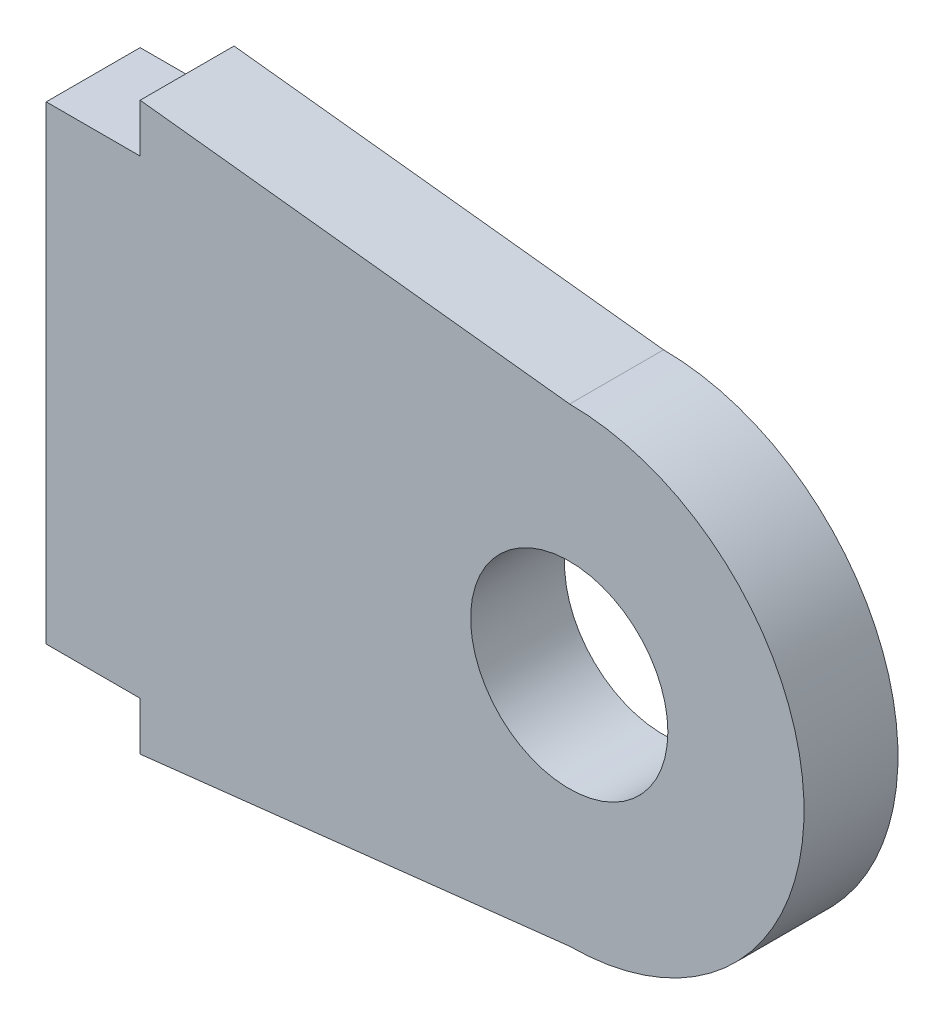
ISO-10303-21;
HEADER;
FILE_DESCRIPTION(('STEP AP214'),'2;1');
FILE_NAME('part.step','',(''),(''),'','','');
FILE_SCHEMA(('AUTOMOTIVE_DESIGN { 1 0 10303 214 1 1 1 1 }'));
ENDSEC;
DATA;
#1=APPLICATION_CONTEXT('core data for automotive mechanical design processes');
#2=APPLICATION_PROTOCOL_DEFINITION('international standard','automotive_design',2000,#1);
#3=PRODUCT_CONTEXT('',#1,'mechanical');
#4=PRODUCT('Part','Part','',(#3));
#5=PRODUCT_RELATED_PRODUCT_CATEGORY('part','',(#4));
#6=PRODUCT_DEFINITION_FORMATION('','',#4);
#7=PRODUCT_DEFINITION_CONTEXT('part definition',#1,'design');
#8=PRODUCT_DEFINITION('design','',#6,#7);
#9=PRODUCT_DEFINITION_SHAPE('','',#8);
#10=(LENGTH_UNIT() NAMED_UNIT(*) SI_UNIT(.MILLI.,.METRE.));
#11=(NAMED_UNIT(*) PLANE_ANGLE_UNIT() SI_UNIT($,.RADIAN.));
#12=(NAMED_UNIT(*) SI_UNIT($,.STERADIAN.) SOLID_ANGLE_UNIT());
#13=UNCERTAINTY_MEASURE_WITH_UNIT(LENGTH_MEASURE(1.E-05),#10,'distance_accuracy_value','');
#14=(GEOMETRIC_REPRESENTATION_CONTEXT(3) GLOBAL_UNCERTAINTY_ASSIGNED_CONTEXT((#13)) GLOBAL_UNIT_ASSIGNED_CONTEXT((#10,
#11,#12)) REPRESENTATION_CONTEXT('',''));
#15=CARTESIAN_POINT('',(0.,0.,0.));
#16=DIRECTION('',(0.,0.,1.));
#17=DIRECTION('',(1.,0.,0.));
#18=AXIS2_PLACEMENT_3D('',#15,#16,#17);
#19=CARTESIAN_POINT('',(0.878927207423718,-7.8073920540141,4.));
#20=DIRECTION('',(-0.111869633286238,0.993722891528822,0.));
#21=DIRECTION('',(-0.993722891528822,-0.111869633286239,0.));
#22=AXIS2_PLACEMENT_3D('',#19,#20,#21);
#23=PLANE('',#22);
#24=DIRECTION('',(0.993722891528822,0.111869633286238,0.));
#25=VECTOR('',#24,1.);
#26=CARTESIAN_POINT('',(0.878927207423718,-7.8073920540141,0.));
#27=LINE('',#26,#25);
#28=CARTESIAN_POINT('',(2.,-7.68118584173721,0.));
#29=VERTEX_POINT('',#28);
#30=CARTESIAN_POINT('',(20.2922651244406,-5.62191055595049,0.));
#31=VERTEX_POINT('',#30);
#32=EDGE_CURVE('E141',#29,#31,#27,.T.);
#33=ORIENTED_EDGE('',*,*,#32,.T.);
#34=DIRECTION('',(0.,0.,-1.));
#35=VECTOR('',#34,1.);
#36=CARTESIAN_POINT('',(20.2922651244406,-5.62191055595049,4.));
#37=LINE('',#36,#35);
#38=CARTESIAN_POINT('',(20.2922651244406,-5.62191055595049,4.));
#39=VERTEX_POINT('',#38);
#40=EDGE_CURVE('E11',#39,#31,#37,.T.);
#41=ORIENTED_EDGE('',*,*,#40,.F.);
#42=DIRECTION('',(0.993722891528822,0.111869633286238,0.));
#43=VECTOR('',#42,1.);
#44=CARTESIAN_POINT('',(0.878927207423718,-7.8073920540141,4.));
#45=LINE('',#44,#43);
#46=CARTESIAN_POINT('',(2.,-7.68118584173721,4.));
#47=VERTEX_POINT('',#46);
#48=EDGE_CURVE('E163',#47,#39,#45,.T.);
#49=ORIENTED_EDGE('',*,*,#48,.F.);
#50=DIRECTION('',(0.,0.,-1.));
#51=VECTOR('',#50,1.);
#52=CARTESIAN_POINT('',(2.,-7.68118584173721,4.));
#53=LINE('',#52,#51);
#54=EDGE_CURVE('E55',#47,#29,#53,.T.);
#55=ORIENTED_EDGE('',*,*,#54,.T.);
#56=EDGE_LOOP('',(#33,#41,#49,#55));
#57=FACE_BOUND('',#56,.T.);
#58=ADVANCED_FACE('F39',(#57),#23,.F.);
#59=CARTESIAN_POINT('',(20.2761325622203,4.37808944404951,4.));
#60=DIRECTION('',(0.,0.,-1.));
#61=DIRECTION('',(-1.,0.,0.));
#62=AXIS2_PLACEMENT_3D('',#59,#60,#61);
#63=CYLINDRICAL_SURFACE('',#62,10.0000130129697);
#64=CARTESIAN_POINT('',(20.2761325622203,4.37808944404951,0.));
#65=DIRECTION('',(0.,0.,1.));
#66=DIRECTION('',(1.,0.,0.));
#67=AXIS2_PLACEMENT_3D('',#64,#65,#66);
#68=CIRCLE('',#67,10.0000130129697);
#69=CARTESIAN_POINT('',(20.2922651244406,14.3780894440495,0.));
#70=VERTEX_POINT('',#69);
#71=EDGE_CURVE('E143',#31,#70,#68,.T.);
#72=ORIENTED_EDGE('',*,*,#71,.T.);
#73=DIRECTION('',(0.,0.,-1.));
#74=VECTOR('',#73,1.);
#75=CARTESIAN_POINT('',(20.2922651244406,14.3780894440495,4.));
#76=LINE('',#75,#74);
#77=CARTESIAN_POINT('',(20.2922651244406,14.3780894440495,4.));
#78=VERTEX_POINT('',#77);
#79=EDGE_CURVE('E47',#78,#70,#76,.T.);
#80=ORIENTED_EDGE('',*,*,#79,.F.);
#81=CARTESIAN_POINT('',(20.2761325622203,4.37808944404951,4.));
#82=DIRECTION('',(0.,0.,1.));
#83=DIRECTION('',(1.,0.,0.));
#84=AXIS2_PLACEMENT_3D('',#81,#82,#83);
#85=CIRCLE('',#84,10.0000130129697);
#86=EDGE_CURVE('E94',#39,#78,#85,.T.);
#87=ORIENTED_EDGE('',*,*,#86,.F.);
#88=ORIENTED_EDGE('',*,*,#40,.T.);
#89=EDGE_LOOP('',(#72,#80,#87,#88));
#90=FACE_BOUND('',#89,.T.);
#91=ADVANCED_FACE('F176',(#90),#63,.T.);
#92=CARTESIAN_POINT('',(1.85232898374949,16.4539889845211,4.));
#93=DIRECTION('',(0.111869633286238,0.993722891528822,0.));
#94=DIRECTION('',(-0.993722891528822,0.111869633286239,0.));
#95=AXIS2_PLACEMENT_3D('',#92,#93,#94);
#96=PLANE('',#95);
#97=DIRECTION('',(0.993722891528822,-0.111869633286238,0.));
#98=VECTOR('',#97,1.);
#99=CARTESIAN_POINT('',(1.85232898374949,16.4539889845211,0.));
#100=LINE('',#99,#98);
#101=CARTESIAN_POINT('',(2.,16.4373647298362,0.));
#102=VERTEX_POINT('',#101);
#103=EDGE_CURVE('E146',#102,#70,#100,.T.);
#104=ORIENTED_EDGE('',*,*,#103,.F.);
#105=DIRECTION('',(0.,0.,-1.));
#106=VECTOR('',#105,1.);
#107=CARTESIAN_POINT('',(2.,16.4373647298362,4.));
#108=LINE('',#107,#106);
#109=CARTESIAN_POINT('',(2.,16.4373647298362,4.));
#110=VERTEX_POINT('',#109);
#111=EDGE_CURVE('E169',#110,#102,#108,.T.);
#112=ORIENTED_EDGE('',*,*,#111,.F.);
#113=DIRECTION('',(0.993722891528822,-0.111869633286238,0.));
#114=VECTOR('',#113,1.);
#115=CARTESIAN_POINT('',(1.85232898374949,16.4539889845211,4.));
#116=LINE('',#115,#114);
#117=EDGE_CURVE('E175',#110,#78,#116,.T.);
#118=ORIENTED_EDGE('',*,*,#117,.T.);
#119=ORIENTED_EDGE('',*,*,#79,.T.);
#120=EDGE_LOOP('',(#104,#112,#118,#119));
#121=FACE_BOUND('',#120,.T.);
#122=ADVANCED_FACE('F173',(#121),#96,.T.);
#123=CARTESIAN_POINT('',(2.,0.,4.));
#124=DIRECTION('',(-1.,0.,0.));
#125=DIRECTION('',(0.,0.,1.));
#126=AXIS2_PLACEMENT_3D('',#123,#124,#125);
#127=PLANE('',#126);
#128=DIRECTION('',(0.,1.,0.));
#129=VECTOR('',#128,1.);
#130=CARTESIAN_POINT('',(2.,0.,0.));
#131=LINE('',#130,#129);
#132=CARTESIAN_POINT('',(2.,14.3780894440495,0.));
#133=VERTEX_POINT('',#132);
#134=EDGE_CURVE('E149',#133,#102,#131,.T.);
#135=ORIENTED_EDGE('',*,*,#134,.F.);
#136=DIRECTION('',(0.,0.,-1.));
#137=VECTOR('',#136,1.);
#138=CARTESIAN_POINT('',(2.,14.3780894440495,4.));
#139=LINE('',#138,#137);
#140=CARTESIAN_POINT('',(2.,14.3780894440495,4.));
#141=VERTEX_POINT('',#140);
#142=EDGE_CURVE('E167',#141,#133,#139,.T.);
#143=ORIENTED_EDGE('',*,*,#142,.F.);
#144=DIRECTION('',(0.,1.,0.));
#145=VECTOR('',#144,1.);
#146=CARTESIAN_POINT('',(2.,0.,4.));
#147=LINE('',#146,#145);
#148=EDGE_CURVE('E186',#141,#110,#147,.T.);
#149=ORIENTED_EDGE('',*,*,#148,.T.);
#150=ORIENTED_EDGE('',*,*,#111,.T.);
#151=EDGE_LOOP('',(#135,#143,#149,#150));
#152=FACE_BOUND('',#151,.T.);
#153=ADVANCED_FACE('F184',(#152),#127,.T.);
#154=CARTESIAN_POINT('',(0.,14.3780894440495,4.));
#155=DIRECTION('',(0.,-1.,0.));
#156=DIRECTION('',(0.,0.,-1.));
#157=AXIS2_PLACEMENT_3D('',#154,#155,#156);
#158=PLANE('',#157);
#159=DIRECTION('',(-1.,0.,0.));
#160=VECTOR('',#159,1.);
#161=CARTESIAN_POINT('',(0.,14.3780894440495,0.));
#162=LINE('',#161,#160);
#163=CARTESIAN_POINT('',(-2.,14.3780894440495,0.));
#164=VERTEX_POINT('',#163);
#165=EDGE_CURVE('E152',#133,#164,#162,.T.);
#166=ORIENTED_EDGE('',*,*,#165,.T.);
#167=DIRECTION('',(0.,0.,-1.));
#168=VECTOR('',#167,1.);
#169=CARTESIAN_POINT('',(-2.,14.3780894440495,4.));
#170=LINE('',#169,#168);
#171=CARTESIAN_POINT('',(-2.,14.3780894440495,4.));
#172=VERTEX_POINT('',#171);
#173=EDGE_CURVE('E130',#172,#164,#170,.T.);
#174=ORIENTED_EDGE('',*,*,#173,.F.);
#175=DIRECTION('',(-1.,0.,0.));
#176=VECTOR('',#175,1.);
#177=CARTESIAN_POINT('',(0.,14.3780894440495,4.));
#178=LINE('',#177,#176);
#179=EDGE_CURVE('E118',#141,#172,#178,.T.);
#180=ORIENTED_EDGE('',*,*,#179,.F.);
#181=ORIENTED_EDGE('',*,*,#142,.T.);
#182=EDGE_LOOP('',(#166,#174,#180,#181));
#183=FACE_BOUND('',#182,.T.);
#184=ADVANCED_FACE('F213',(#183),#158,.F.);
#185=CARTESIAN_POINT('',(-2.,0.,4.));
#186=DIRECTION('',(1.,0.,0.));
#187=DIRECTION('',(0.,0.,-1.));
#188=AXIS2_PLACEMENT_3D('',#185,#186,#187);
#189=PLANE('',#188);
#190=DIRECTION('',(0.,-1.,0.));
#191=VECTOR('',#190,1.);
#192=CARTESIAN_POINT('',(-2.,0.,0.));
#193=LINE('',#192,#191);
#194=CARTESIAN_POINT('',(-2.,-5.62191055595049,0.));
#195=VERTEX_POINT('',#194);
#196=EDGE_CURVE('E127',#164,#195,#193,.T.);
#197=ORIENTED_EDGE('',*,*,#196,.T.);
#198=DIRECTION('',(0.,0.,-1.));
#199=VECTOR('',#198,1.);
#200=CARTESIAN_POINT('',(-2.,-5.62191055595049,4.));
#201=LINE('',#200,#199);
#202=CARTESIAN_POINT('',(-2.,-5.62191055595049,4.));
#203=VERTEX_POINT('',#202);
#204=EDGE_CURVE('E124',#203,#195,#201,.T.);
#205=ORIENTED_EDGE('',*,*,#204,.F.);
#206=DIRECTION('',(0.,-1.,0.));
#207=VECTOR('',#206,1.);
#208=CARTESIAN_POINT('',(-2.,0.,4.));
#209=LINE('',#208,#207);
#210=EDGE_CURVE('E109',#172,#203,#209,.T.);
#211=ORIENTED_EDGE('',*,*,#210,.F.);
#212=ORIENTED_EDGE('',*,*,#173,.T.);
#213=EDGE_LOOP('',(#197,#205,#211,#212));
#214=FACE_BOUND('',#213,.T.);
#215=ADVANCED_FACE('F125',(#214),#189,.F.);
#216=CARTESIAN_POINT('',(0.,-5.62191055595049,4.));
#217=DIRECTION('',(0.,1.,0.));
#218=DIRECTION('',(0.,0.,1.));
#219=AXIS2_PLACEMENT_3D('',#216,#217,#218);
#220=PLANE('',#219);
#221=DIRECTION('',(1.,0.,0.));
#222=VECTOR('',#221,1.);
#223=CARTESIAN_POINT('',(0.,-5.62191055595049,0.));
#224=LINE('',#223,#222);
#225=CARTESIAN_POINT('',(2.,-5.62191055595049,0.));
#226=VERTEX_POINT('',#225);
#227=EDGE_CURVE('E155',#195,#226,#224,.T.);
#228=ORIENTED_EDGE('',*,*,#227,.T.);
#229=DIRECTION('',(0.,0.,-1.));
#230=VECTOR('',#229,1.);
#231=CARTESIAN_POINT('',(2.,-5.62191055595049,4.));
#232=LINE('',#231,#230);
#233=CARTESIAN_POINT('',(2.,-5.62191055595049,4.));
#234=VERTEX_POINT('',#233);
#235=EDGE_CURVE('E82',#234,#226,#232,.T.);
#236=ORIENTED_EDGE('',*,*,#235,.F.);
#237=DIRECTION('',(1.,0.,0.));
#238=VECTOR('',#237,1.);
#239=CARTESIAN_POINT('',(0.,-5.62191055595049,4.));
#240=LINE('',#239,#238);
#241=EDGE_CURVE('E115',#203,#234,#240,.T.);
#242=ORIENTED_EDGE('',*,*,#241,.F.);
#243=ORIENTED_EDGE('',*,*,#204,.T.);
#244=EDGE_LOOP('',(#228,#236,#242,#243));
#245=FACE_BOUND('',#244,.T.);
#246=ADVANCED_FACE('F132',(#245),#220,.F.);
#247=CARTESIAN_POINT('',(2.,0.,4.));
#248=DIRECTION('',(-1.,0.,0.));
#249=DIRECTION('',(0.,0.,1.));
#250=AXIS2_PLACEMENT_3D('',#247,#248,#249);
#251=PLANE('',#250);
#252=DIRECTION('',(0.,1.,0.));
#253=VECTOR('',#252,1.);
#254=CARTESIAN_POINT('',(2.,0.,0.));
#255=LINE('',#254,#253);
#256=EDGE_CURVE('E157',#29,#226,#255,.T.);
#257=ORIENTED_EDGE('',*,*,#256,.F.);
#258=ORIENTED_EDGE('',*,*,#54,.F.);
#259=DIRECTION('',(0.,1.,0.));
#260=VECTOR('',#259,1.);
#261=CARTESIAN_POINT('',(2.,0.,4.));
#262=LINE('',#261,#260);
#263=EDGE_CURVE('E133',#47,#234,#262,.T.);
#264=ORIENTED_EDGE('',*,*,#263,.T.);
#265=ORIENTED_EDGE('',*,*,#235,.T.);
#266=EDGE_LOOP('',(#257,#258,#264,#265));
#267=FACE_BOUND('',#266,.T.);
#268=ADVANCED_FACE('F191',(#267),#251,.T.);
#269=CARTESIAN_POINT('',(20.2761325622203,4.37808944404951,4.));
#270=DIRECTION('',(0.,0.,-1.));
#271=DIRECTION('',(-1.,0.,0.));
#272=AXIS2_PLACEMENT_3D('',#269,#270,#271);
#273=CYLINDRICAL_SURFACE('',#272,4.2);
#274=CARTESIAN_POINT('',(20.2761325622203,4.37808944404951,4.));
#275=DIRECTION('',(0.,0.,1.));
#276=DIRECTION('',(1.,0.,0.));
#277=AXIS2_PLACEMENT_3D('',#274,#275,#276);
#278=CIRCLE('',#277,4.2);
#279=CARTESIAN_POINT('',(24.4761325622203,4.37808944404951,4.));
#280=VERTEX_POINT('',#279);
#281=EDGE_CURVE('E135',#280,#280,#278,.T.);
#282=ORIENTED_EDGE('',*,*,#281,.T.);
#283=EDGE_LOOP('',(#282));
#284=FACE_BOUND('',#283,.T.);
#285=CARTESIAN_POINT('',(20.2761325622203,4.37808944404951,0.));
#286=DIRECTION('',(0.,0.,1.));
#287=DIRECTION('',(1.,0.,0.));
#288=AXIS2_PLACEMENT_3D('',#285,#286,#287);
#289=CIRCLE('',#288,4.2);
#290=CARTESIAN_POINT('',(24.4761325622203,4.37808944404951,0.));
#291=VERTEX_POINT('',#290);
#292=EDGE_CURVE('E160',#291,#291,#289,.T.);
#293=ORIENTED_EDGE('',*,*,#292,.F.);
#294=EDGE_LOOP('',(#293));
#295=FACE_BOUND('',#294,.T.);
#296=ADVANCED_FACE('F193',(#284,#295),#273,.F.);
#297=CARTESIAN_POINT('',(0.,0.,4.));
#298=DIRECTION('',(0.,0.,1.));
#299=DIRECTION('',(1.,0.,0.));
#300=AXIS2_PLACEMENT_3D('',#297,#298,#299);
#301=PLANE('',#300);
#302=ORIENTED_EDGE('',*,*,#48,.T.);
#303=ORIENTED_EDGE('',*,*,#86,.T.);
#304=ORIENTED_EDGE('',*,*,#117,.F.);
#305=ORIENTED_EDGE('',*,*,#148,.F.);
#306=ORIENTED_EDGE('',*,*,#179,.T.);
#307=ORIENTED_EDGE('',*,*,#210,.T.);
#308=ORIENTED_EDGE('',*,*,#241,.T.);
#309=ORIENTED_EDGE('',*,*,#263,.F.);
#310=EDGE_LOOP('',(#302,#303,#304,#305,#306,#307,#308,#309));
#311=FACE_BOUND('',#310,.T.);
#312=ORIENTED_EDGE('',*,*,#281,.F.);
#313=EDGE_LOOP('',(#312));
#314=FACE_BOUND('',#313,.T.);
#315=ADVANCED_FACE('F111',(#311,#314),#301,.T.);
#316=CARTESIAN_POINT('',(0.,0.,0.));
#317=DIRECTION('',(0.,0.,1.));
#318=DIRECTION('',(1.,0.,0.));
#319=AXIS2_PLACEMENT_3D('',#316,#317,#318);
#320=PLANE('',#319);
#321=ORIENTED_EDGE('',*,*,#32,.F.);
#322=ORIENTED_EDGE('',*,*,#256,.T.);
#323=ORIENTED_EDGE('',*,*,#227,.F.);
#324=ORIENTED_EDGE('',*,*,#196,.F.);
#325=ORIENTED_EDGE('',*,*,#165,.F.);
#326=ORIENTED_EDGE('',*,*,#134,.T.);
#327=ORIENTED_EDGE('',*,*,#103,.T.);
#328=ORIENTED_EDGE('',*,*,#71,.F.);
#329=EDGE_LOOP('',(#321,#322,#323,#324,#325,#326,#327,#328));
#330=FACE_BOUND('',#329,.T.);
#331=ORIENTED_EDGE('',*,*,#292,.T.);
#332=EDGE_LOOP('',(#331));
#333=FACE_BOUND('',#332,.T.);
#334=ADVANCED_FACE('F179',(#330,#333),#320,.F.);
#335=CLOSED_SHELL('',(#58,#91,#122,#153,#184,#215,#246,#268,#296,#315,#334));
#336=MANIFOLD_SOLID_BREP('B2',#335);
#337=ADVANCED_BREP_SHAPE_REPRESENTATION('',(#18,#336),#14);
#338=SHAPE_DEFINITION_REPRESENTATION(#9,#337);
ENDSEC;
END-ISO-10303-21;
